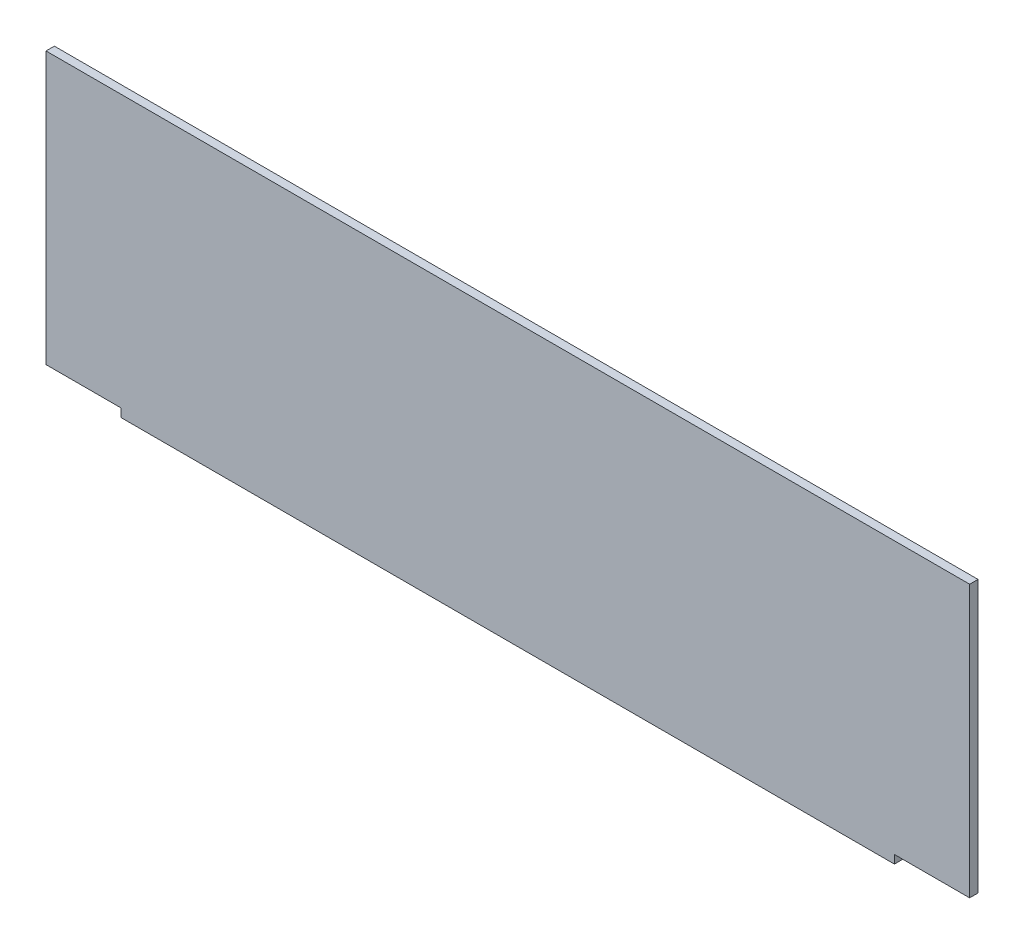
ISO-10303-21;
HEADER;
FILE_DESCRIPTION(('STEP AP214'),'2;1');
FILE_NAME('part.step','',(''),(''),'','','');
FILE_SCHEMA(('AUTOMOTIVE_DESIGN { 1 0 10303 214 1 1 1 1 }'));
ENDSEC;
DATA;
#1=APPLICATION_CONTEXT('core data for automotive mechanical design processes');
#2=APPLICATION_PROTOCOL_DEFINITION('international standard','automotive_design',2000,#1);
#3=PRODUCT_CONTEXT('',#1,'mechanical');
#4=PRODUCT('Part','Part','',(#3));
#5=PRODUCT_RELATED_PRODUCT_CATEGORY('part','',(#4));
#6=PRODUCT_DEFINITION_FORMATION('','',#4);
#7=PRODUCT_DEFINITION_CONTEXT('part definition',#1,'design');
#8=PRODUCT_DEFINITION('design','',#6,#7);
#9=PRODUCT_DEFINITION_SHAPE('','',#8);
#10=(LENGTH_UNIT() NAMED_UNIT(*) SI_UNIT(.MILLI.,.METRE.));
#11=(NAMED_UNIT(*) PLANE_ANGLE_UNIT() SI_UNIT($,.RADIAN.));
#12=(NAMED_UNIT(*) SI_UNIT($,.STERADIAN.) SOLID_ANGLE_UNIT());
#13=UNCERTAINTY_MEASURE_WITH_UNIT(LENGTH_MEASURE(1.E-05),#10,'distance_accuracy_value','');
#14=(GEOMETRIC_REPRESENTATION_CONTEXT(3) GLOBAL_UNCERTAINTY_ASSIGNED_CONTEXT((#13)) GLOBAL_UNIT_ASSIGNED_CONTEXT((#10,
#11,#12)) REPRESENTATION_CONTEXT('',''));
#15=CARTESIAN_POINT('',(0.,0.,0.));
#16=DIRECTION('',(0.,0.,1.));
#17=DIRECTION('',(1.,0.,0.));
#18=AXIS2_PLACEMENT_3D('',#15,#16,#17);
#19=CARTESIAN_POINT('',(110.5,-31.5,2.));
#20=DIRECTION('',(-1.,0.,0.));
#21=DIRECTION('',(0.,0.,1.));
#22=AXIS2_PLACEMENT_3D('',#19,#20,#21);
#23=PLANE('',#22);
#24=DIRECTION('',(0.,1.,0.));
#25=VECTOR('',#24,1.);
#26=CARTESIAN_POINT('',(110.5,-31.5,0.));
#27=LINE('',#26,#25);
#28=CARTESIAN_POINT('',(110.5,-31.5,0.));
#29=VERTEX_POINT('',#28);
#30=CARTESIAN_POINT('',(110.5,33.5,0.));
#31=VERTEX_POINT('',#30);
#32=EDGE_CURVE('E131',#29,#31,#27,.T.);
#33=ORIENTED_EDGE('',*,*,#32,.T.);
#34=DIRECTION('',(0.,0.,-1.));
#35=VECTOR('',#34,1.);
#36=CARTESIAN_POINT('',(110.5,33.5,2.));
#37=LINE('',#36,#35);
#38=CARTESIAN_POINT('',(110.5,33.5,2.));
#39=VERTEX_POINT('',#38);
#40=EDGE_CURVE('E11',#39,#31,#37,.T.);
#41=ORIENTED_EDGE('',*,*,#40,.F.);
#42=DIRECTION('',(0.,1.,0.));
#43=VECTOR('',#42,1.);
#44=CARTESIAN_POINT('',(110.5,-31.5,2.));
#45=LINE('',#44,#43);
#46=CARTESIAN_POINT('',(110.5,-31.5,2.));
#47=VERTEX_POINT('',#46);
#48=EDGE_CURVE('E145',#47,#39,#45,.T.);
#49=ORIENTED_EDGE('',*,*,#48,.F.);
#50=DIRECTION('',(0.,0.,-1.));
#51=VECTOR('',#50,1.);
#52=CARTESIAN_POINT('',(110.5,-31.5,2.));
#53=LINE('',#52,#51);
#54=EDGE_CURVE('E127',#47,#29,#53,.T.);
#55=ORIENTED_EDGE('',*,*,#54,.T.);
#56=EDGE_LOOP('',(#33,#41,#49,#55));
#57=FACE_BOUND('',#56,.T.);
#58=ADVANCED_FACE('F35',(#57),#23,.F.);
#59=CARTESIAN_POINT('',(-110.5,33.5,2.));
#60=DIRECTION('',(0.,-1.,0.));
#61=DIRECTION('',(0.,0.,-1.));
#62=AXIS2_PLACEMENT_3D('',#59,#60,#61);
#63=PLANE('',#62);
#64=DIRECTION('',(-1.,0.,0.));
#65=VECTOR('',#64,1.);
#66=CARTESIAN_POINT('',(-110.5,33.5,0.));
#67=LINE('',#66,#65);
#68=CARTESIAN_POINT('',(-110.5,33.5,0.));
#69=VERTEX_POINT('',#68);
#70=EDGE_CURVE('E134',#31,#69,#67,.T.);
#71=ORIENTED_EDGE('',*,*,#70,.T.);
#72=DIRECTION('',(0.,0.,-1.));
#73=VECTOR('',#72,1.);
#74=CARTESIAN_POINT('',(-110.5,33.5,2.));
#75=LINE('',#74,#73);
#76=CARTESIAN_POINT('',(-110.5,33.5,2.));
#77=VERTEX_POINT('',#76);
#78=EDGE_CURVE('E43',#77,#69,#75,.T.);
#79=ORIENTED_EDGE('',*,*,#78,.F.);
#80=DIRECTION('',(-1.,0.,0.));
#81=VECTOR('',#80,1.);
#82=CARTESIAN_POINT('',(-110.5,33.5,2.));
#83=LINE('',#82,#81);
#84=EDGE_CURVE('E94',#39,#77,#83,.T.);
#85=ORIENTED_EDGE('',*,*,#84,.F.);
#86=ORIENTED_EDGE('',*,*,#40,.T.);
#87=EDGE_LOOP('',(#71,#79,#85,#86));
#88=FACE_BOUND('',#87,.T.);
#89=ADVANCED_FACE('F180',(#88),#63,.F.);
#90=CARTESIAN_POINT('',(-110.5,-31.5,2.));
#91=DIRECTION('',(1.,0.,0.));
#92=DIRECTION('',(0.,1.,0.));
#93=AXIS2_PLACEMENT_3D('',#90,#91,#92);
#94=PLANE('',#93);
#95=DIRECTION('',(0.,-1.,0.));
#96=VECTOR('',#95,1.);
#97=CARTESIAN_POINT('',(-110.5,-31.5,0.));
#98=LINE('',#97,#96);
#99=CARTESIAN_POINT('',(-110.5,-31.5,0.));
#100=VERTEX_POINT('',#99);
#101=EDGE_CURVE('E136',#69,#100,#98,.T.);
#102=ORIENTED_EDGE('',*,*,#101,.T.);
#103=DIRECTION('',(0.,0.,-1.));
#104=VECTOR('',#103,1.);
#105=CARTESIAN_POINT('',(-110.5,-31.5,2.));
#106=LINE('',#105,#104);
#107=CARTESIAN_POINT('',(-110.5,-31.5,2.));
#108=VERTEX_POINT('',#107);
#109=EDGE_CURVE('E152',#108,#100,#106,.T.);
#110=ORIENTED_EDGE('',*,*,#109,.F.);
#111=DIRECTION('',(0.,-1.,0.));
#112=VECTOR('',#111,1.);
#113=CARTESIAN_POINT('',(-110.5,-31.5,2.));
#114=LINE('',#113,#112);
#115=EDGE_CURVE('E160',#77,#108,#114,.T.);
#116=ORIENTED_EDGE('',*,*,#115,.F.);
#117=ORIENTED_EDGE('',*,*,#78,.T.);
#118=EDGE_LOOP('',(#102,#110,#116,#117));
#119=FACE_BOUND('',#118,.T.);
#120=ADVANCED_FACE('F158',(#119),#94,.F.);
#121=CARTESIAN_POINT('',(-110.5,-31.5,2.));
#122=DIRECTION('',(0.,1.,0.));
#123=DIRECTION('',(0.,0.,1.));
#124=AXIS2_PLACEMENT_3D('',#121,#122,#123);
#125=PLANE('',#124);
#126=DIRECTION('',(1.,0.,0.));
#127=VECTOR('',#126,1.);
#128=CARTESIAN_POINT('',(-110.5,-31.5,0.));
#129=LINE('',#128,#127);
#130=CARTESIAN_POINT('',(-92.5,-31.5,0.));
#131=VERTEX_POINT('',#130);
#132=EDGE_CURVE('E138',#100,#131,#129,.T.);
#133=ORIENTED_EDGE('',*,*,#132,.T.);
#134=DIRECTION('',(0.,0.,-1.));
#135=VECTOR('',#134,1.);
#136=CARTESIAN_POINT('',(-92.5,-31.5,2.));
#137=LINE('',#136,#135);
#138=CARTESIAN_POINT('',(-92.5,-31.5,2.));
#139=VERTEX_POINT('',#138);
#140=EDGE_CURVE('E149',#139,#131,#137,.T.);
#141=ORIENTED_EDGE('',*,*,#140,.F.);
#142=DIRECTION('',(1.,0.,0.));
#143=VECTOR('',#142,1.);
#144=CARTESIAN_POINT('',(-110.5,-31.5,2.));
#145=LINE('',#144,#143);
#146=EDGE_CURVE('E172',#108,#139,#145,.T.);
#147=ORIENTED_EDGE('',*,*,#146,.F.);
#148=ORIENTED_EDGE('',*,*,#109,.T.);
#149=EDGE_LOOP('',(#133,#141,#147,#148));
#150=FACE_BOUND('',#149,.T.);
#151=ADVANCED_FACE('F168',(#150),#125,.F.);
#152=CARTESIAN_POINT('',(-92.5,-33.5,2.));
#153=DIRECTION('',(1.,0.,0.));
#154=DIRECTION('',(0.,0.,-1.));
#155=AXIS2_PLACEMENT_3D('',#152,#153,#154);
#156=PLANE('',#155);
#157=DIRECTION('',(0.,-1.,0.));
#158=VECTOR('',#157,1.);
#159=CARTESIAN_POINT('',(-92.5,-33.5,0.));
#160=LINE('',#159,#158);
#161=CARTESIAN_POINT('',(-92.5,-33.5,0.));
#162=VERTEX_POINT('',#161);
#163=EDGE_CURVE('E140',#131,#162,#160,.T.);
#164=ORIENTED_EDGE('',*,*,#163,.T.);
#165=DIRECTION('',(0.,0.,-1.));
#166=VECTOR('',#165,1.);
#167=CARTESIAN_POINT('',(-92.5,-33.5,2.));
#168=LINE('',#167,#166);
#169=CARTESIAN_POINT('',(-92.5,-33.5,2.));
#170=VERTEX_POINT('',#169);
#171=EDGE_CURVE('E122',#170,#162,#168,.T.);
#172=ORIENTED_EDGE('',*,*,#171,.F.);
#173=DIRECTION('',(0.,-1.,0.));
#174=VECTOR('',#173,1.);
#175=CARTESIAN_POINT('',(-92.5,-33.5,2.));
#176=LINE('',#175,#174);
#177=EDGE_CURVE('E113',#139,#170,#176,.T.);
#178=ORIENTED_EDGE('',*,*,#177,.F.);
#179=ORIENTED_EDGE('',*,*,#140,.T.);
#180=EDGE_LOOP('',(#164,#172,#178,#179));
#181=FACE_BOUND('',#180,.T.);
#182=ADVANCED_FACE('F171',(#181),#156,.F.);
#183=CARTESIAN_POINT('',(-92.5,-33.5,2.));
#184=DIRECTION('',(0.,1.,0.));
#185=DIRECTION('',(-1.,0.,0.));
#186=AXIS2_PLACEMENT_3D('',#183,#184,#185);
#187=PLANE('',#186);
#188=DIRECTION('',(1.,0.,0.));
#189=VECTOR('',#188,1.);
#190=CARTESIAN_POINT('',(-92.5,-33.5,0.));
#191=LINE('',#190,#189);
#192=CARTESIAN_POINT('',(92.5,-33.5,0.));
#193=VERTEX_POINT('',#192);
#194=EDGE_CURVE('E121',#162,#193,#191,.T.);
#195=ORIENTED_EDGE('',*,*,#194,.T.);
#196=DIRECTION('',(0.,0.,-1.));
#197=VECTOR('',#196,1.);
#198=CARTESIAN_POINT('',(92.5,-33.5,2.));
#199=LINE('',#198,#197);
#200=CARTESIAN_POINT('',(92.5,-33.5,2.));
#201=VERTEX_POINT('',#200);
#202=EDGE_CURVE('E118',#201,#193,#199,.T.);
#203=ORIENTED_EDGE('',*,*,#202,.F.);
#204=DIRECTION('',(1.,0.,0.));
#205=VECTOR('',#204,1.);
#206=CARTESIAN_POINT('',(-92.5,-33.5,2.));
#207=LINE('',#206,#205);
#208=EDGE_CURVE('E107',#170,#201,#207,.T.);
#209=ORIENTED_EDGE('',*,*,#208,.F.);
#210=ORIENTED_EDGE('',*,*,#171,.T.);
#211=EDGE_LOOP('',(#195,#203,#209,#210));
#212=FACE_BOUND('',#211,.T.);
#213=ADVANCED_FACE('F119',(#212),#187,.F.);
#214=CARTESIAN_POINT('',(92.5,-33.5,2.));
#215=DIRECTION('',(-1.,0.,0.));
#216=DIRECTION('',(0.,0.,1.));
#217=AXIS2_PLACEMENT_3D('',#214,#215,#216);
#218=PLANE('',#217);
#219=DIRECTION('',(0.,1.,0.));
#220=VECTOR('',#219,1.);
#221=CARTESIAN_POINT('',(92.5,-33.5,0.));
#222=LINE('',#221,#220);
#223=CARTESIAN_POINT('',(92.5,-31.5,0.));
#224=VERTEX_POINT('',#223);
#225=EDGE_CURVE('E80',#193,#224,#222,.T.);
#226=ORIENTED_EDGE('',*,*,#225,.T.);
#227=DIRECTION('',(0.,0.,-1.));
#228=VECTOR('',#227,1.);
#229=CARTESIAN_POINT('',(92.5,-31.5,2.));
#230=LINE('',#229,#228);
#231=CARTESIAN_POINT('',(92.5,-31.5,2.));
#232=VERTEX_POINT('',#231);
#233=EDGE_CURVE('E123',#232,#224,#230,.T.);
#234=ORIENTED_EDGE('',*,*,#233,.F.);
#235=DIRECTION('',(0.,1.,0.));
#236=VECTOR('',#235,1.);
#237=CARTESIAN_POINT('',(92.5,-33.5,2.));
#238=LINE('',#237,#236);
#239=EDGE_CURVE('E111',#201,#232,#238,.T.);
#240=ORIENTED_EDGE('',*,*,#239,.F.);
#241=ORIENTED_EDGE('',*,*,#202,.T.);
#242=EDGE_LOOP('',(#226,#234,#240,#241));
#243=FACE_BOUND('',#242,.T.);
#244=ADVANCED_FACE('F125',(#243),#218,.F.);
#245=CARTESIAN_POINT('',(110.5,-31.5,2.));
#246=DIRECTION('',(0.,1.,0.));
#247=DIRECTION('',(0.,0.,1.));
#248=AXIS2_PLACEMENT_3D('',#245,#246,#247);
#249=PLANE('',#248);
#250=DIRECTION('',(1.,0.,0.));
#251=VECTOR('',#250,1.);
#252=CARTESIAN_POINT('',(110.5,-31.5,0.));
#253=LINE('',#252,#251);
#254=EDGE_CURVE('E86',#224,#29,#253,.T.);
#255=ORIENTED_EDGE('',*,*,#254,.T.);
#256=ORIENTED_EDGE('',*,*,#54,.F.);
#257=DIRECTION('',(1.,0.,0.));
#258=VECTOR('',#257,1.);
#259=CARTESIAN_POINT('',(110.5,-31.5,2.));
#260=LINE('',#259,#258);
#261=EDGE_CURVE('E51',#232,#47,#260,.T.);
#262=ORIENTED_EDGE('',*,*,#261,.F.);
#263=ORIENTED_EDGE('',*,*,#233,.T.);
#264=EDGE_LOOP('',(#255,#256,#262,#263));
#265=FACE_BOUND('',#264,.T.);
#266=ADVANCED_FACE('F196',(#265),#249,.F.);
#267=CARTESIAN_POINT('',(0.,0.,2.));
#268=DIRECTION('',(0.,0.,-1.));
#269=DIRECTION('',(-1.,0.,0.));
#270=AXIS2_PLACEMENT_3D('',#267,#268,#269);
#271=PLANE('',#270);
#272=ORIENTED_EDGE('',*,*,#48,.T.);
#273=ORIENTED_EDGE('',*,*,#84,.T.);
#274=ORIENTED_EDGE('',*,*,#115,.T.);
#275=ORIENTED_EDGE('',*,*,#146,.T.);
#276=ORIENTED_EDGE('',*,*,#177,.T.);
#277=ORIENTED_EDGE('',*,*,#208,.T.);
#278=ORIENTED_EDGE('',*,*,#239,.T.);
#279=ORIENTED_EDGE('',*,*,#261,.T.);
#280=EDGE_LOOP('',(#272,#273,#274,#275,#276,#277,#278,#279));
#281=FACE_BOUND('',#280,.T.);
#282=ADVANCED_FACE('F109',(#281),#271,.F.);
#283=CARTESIAN_POINT('',(0.,0.,0.));
#284=DIRECTION('',(0.,0.,-1.));
#285=DIRECTION('',(-1.,0.,0.));
#286=AXIS2_PLACEMENT_3D('',#283,#284,#285);
#287=PLANE('',#286);
#288=ORIENTED_EDGE('',*,*,#32,.F.);
#289=ORIENTED_EDGE('',*,*,#254,.F.);
#290=ORIENTED_EDGE('',*,*,#225,.F.);
#291=ORIENTED_EDGE('',*,*,#194,.F.);
#292=ORIENTED_EDGE('',*,*,#163,.F.);
#293=ORIENTED_EDGE('',*,*,#132,.F.);
#294=ORIENTED_EDGE('',*,*,#101,.F.);
#295=ORIENTED_EDGE('',*,*,#70,.F.);
#296=EDGE_LOOP('',(#288,#289,#290,#291,#292,#293,#294,#295));
#297=FACE_BOUND('',#296,.T.);
#298=ADVANCED_FACE('F164',(#297),#287,.T.);
#299=CLOSED_SHELL('',(#58,#89,#120,#151,#182,#213,#244,#266,#282,#298));
#300=MANIFOLD_SOLID_BREP('B2',#299);
#301=ADVANCED_BREP_SHAPE_REPRESENTATION('',(#18,#300),#14);
#302=SHAPE_DEFINITION_REPRESENTATION(#9,#301);
ENDSEC;
END-ISO-10303-21;
